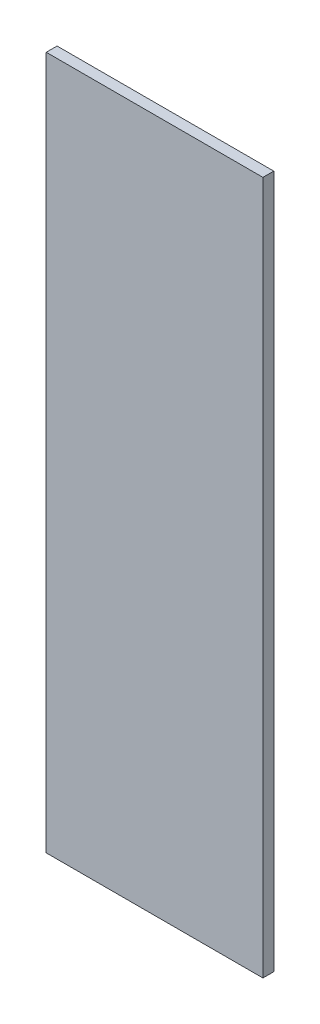
ISO-10303-21;
HEADER;
FILE_DESCRIPTION(('STEP AP214'),'2;1');
FILE_NAME('part.step','',(''),(''),'','','');
FILE_SCHEMA(('AUTOMOTIVE_DESIGN { 1 0 10303 214 1 1 1 1 }'));
ENDSEC;
DATA;
#1=APPLICATION_CONTEXT('core data for automotive mechanical design processes');
#2=APPLICATION_PROTOCOL_DEFINITION('international standard','automotive_design',2000,#1);
#3=PRODUCT_CONTEXT('',#1,'mechanical');
#4=PRODUCT('Part','Part','',(#3));
#5=PRODUCT_RELATED_PRODUCT_CATEGORY('part','',(#4));
#6=PRODUCT_DEFINITION_FORMATION('','',#4);
#7=PRODUCT_DEFINITION_CONTEXT('part definition',#1,'design');
#8=PRODUCT_DEFINITION('design','',#6,#7);
#9=PRODUCT_DEFINITION_SHAPE('','',#8);
#10=(LENGTH_UNIT() NAMED_UNIT(*) SI_UNIT(.MILLI.,.METRE.));
#11=(NAMED_UNIT(*) PLANE_ANGLE_UNIT() SI_UNIT($,.RADIAN.));
#12=(NAMED_UNIT(*) SI_UNIT($,.STERADIAN.) SOLID_ANGLE_UNIT());
#13=UNCERTAINTY_MEASURE_WITH_UNIT(LENGTH_MEASURE(1.E-05),#10,'distance_accuracy_value','');
#14=(GEOMETRIC_REPRESENTATION_CONTEXT(3) GLOBAL_UNCERTAINTY_ASSIGNED_CONTEXT((#13)) GLOBAL_UNIT_ASSIGNED_CONTEXT((#10,
#11,#12)) REPRESENTATION_CONTEXT('',''));
#15=CARTESIAN_POINT('',(0.,0.,0.));
#16=DIRECTION('',(0.,0.,1.));
#17=DIRECTION('',(1.,0.,0.));
#18=AXIS2_PLACEMENT_3D('',#15,#16,#17);
#19=CARTESIAN_POINT('',(50.,-160.,5.));
#20=DIRECTION('',(-1.,0.,0.));
#21=DIRECTION('',(0.,0.,1.));
#22=AXIS2_PLACEMENT_3D('',#19,#20,#21);
#23=PLANE('',#22);
#24=DIRECTION('',(0.,1.,0.));
#25=VECTOR('',#24,1.);
#26=CARTESIAN_POINT('',(50.,-160.,0.));
#27=LINE('',#26,#25);
#28=CARTESIAN_POINT('',(50.,-160.,0.));
#29=VERTEX_POINT('',#28);
#30=CARTESIAN_POINT('',(50.,160.,0.));
#31=VERTEX_POINT('',#30);
#32=EDGE_CURVE('E96',#29,#31,#27,.T.);
#33=ORIENTED_EDGE('',*,*,#32,.T.);
#34=DIRECTION('',(0.,0.,-1.));
#35=VECTOR('',#34,1.);
#36=CARTESIAN_POINT('',(50.,160.,5.));
#37=LINE('',#36,#35);
#38=CARTESIAN_POINT('',(50.,160.,5.));
#39=VERTEX_POINT('',#38);
#40=EDGE_CURVE('E11',#39,#31,#37,.T.);
#41=ORIENTED_EDGE('',*,*,#40,.F.);
#42=DIRECTION('',(0.,1.,0.));
#43=VECTOR('',#42,1.);
#44=CARTESIAN_POINT('',(50.,-160.,5.));
#45=LINE('',#44,#43);
#46=CARTESIAN_POINT('',(50.,-160.,5.));
#47=VERTEX_POINT('',#46);
#48=EDGE_CURVE('E84',#47,#39,#45,.T.);
#49=ORIENTED_EDGE('',*,*,#48,.F.);
#50=DIRECTION('',(0.,0.,-1.));
#51=VECTOR('',#50,1.);
#52=CARTESIAN_POINT('',(50.,-160.,5.));
#53=LINE('',#52,#51);
#54=EDGE_CURVE('E92',#47,#29,#53,.T.);
#55=ORIENTED_EDGE('',*,*,#54,.T.);
#56=EDGE_LOOP('',(#33,#41,#49,#55));
#57=FACE_BOUND('',#56,.T.);
#58=ADVANCED_FACE('F33',(#57),#23,.F.);
#59=CARTESIAN_POINT('',(-50.,160.,5.));
#60=DIRECTION('',(0.,-1.,0.));
#61=DIRECTION('',(0.,0.,-1.));
#62=AXIS2_PLACEMENT_3D('',#59,#60,#61);
#63=PLANE('',#62);
#64=DIRECTION('',(-1.,0.,0.));
#65=VECTOR('',#64,1.);
#66=CARTESIAN_POINT('',(-50.,160.,0.));
#67=LINE('',#66,#65);
#68=CARTESIAN_POINT('',(-50.,160.,0.));
#69=VERTEX_POINT('',#68);
#70=EDGE_CURVE('E88',#31,#69,#67,.T.);
#71=ORIENTED_EDGE('',*,*,#70,.T.);
#72=DIRECTION('',(0.,0.,-1.));
#73=VECTOR('',#72,1.);
#74=CARTESIAN_POINT('',(-50.,160.,5.));
#75=LINE('',#74,#73);
#76=CARTESIAN_POINT('',(-50.,160.,5.));
#77=VERTEX_POINT('',#76);
#78=EDGE_CURVE('E41',#77,#69,#75,.T.);
#79=ORIENTED_EDGE('',*,*,#78,.F.);
#80=DIRECTION('',(-1.,0.,0.));
#81=VECTOR('',#80,1.);
#82=CARTESIAN_POINT('',(-50.,160.,5.));
#83=LINE('',#82,#81);
#84=EDGE_CURVE('E79',#39,#77,#83,.T.);
#85=ORIENTED_EDGE('',*,*,#84,.F.);
#86=ORIENTED_EDGE('',*,*,#40,.T.);
#87=EDGE_LOOP('',(#71,#79,#85,#86));
#88=FACE_BOUND('',#87,.T.);
#89=ADVANCED_FACE('F87',(#88),#63,.F.);
#90=CARTESIAN_POINT('',(-50.,-160.,5.));
#91=DIRECTION('',(1.,0.,0.));
#92=DIRECTION('',(0.,0.,-1.));
#93=AXIS2_PLACEMENT_3D('',#90,#91,#92);
#94=PLANE('',#93);
#95=DIRECTION('',(0.,-1.,0.));
#96=VECTOR('',#95,1.);
#97=CARTESIAN_POINT('',(-50.,-160.,0.));
#98=LINE('',#97,#96);
#99=CARTESIAN_POINT('',(-50.,-160.,0.));
#100=VERTEX_POINT('',#99);
#101=EDGE_CURVE('E66',#69,#100,#98,.T.);
#102=ORIENTED_EDGE('',*,*,#101,.T.);
#103=DIRECTION('',(0.,0.,-1.));
#104=VECTOR('',#103,1.);
#105=CARTESIAN_POINT('',(-50.,-160.,5.));
#106=LINE('',#105,#104);
#107=CARTESIAN_POINT('',(-50.,-160.,5.));
#108=VERTEX_POINT('',#107);
#109=EDGE_CURVE('E89',#108,#100,#106,.T.);
#110=ORIENTED_EDGE('',*,*,#109,.F.);
#111=DIRECTION('',(0.,-1.,0.));
#112=VECTOR('',#111,1.);
#113=CARTESIAN_POINT('',(-50.,-160.,5.));
#114=LINE('',#113,#112);
#115=EDGE_CURVE('E82',#77,#108,#114,.T.);
#116=ORIENTED_EDGE('',*,*,#115,.F.);
#117=ORIENTED_EDGE('',*,*,#78,.T.);
#118=EDGE_LOOP('',(#102,#110,#116,#117));
#119=FACE_BOUND('',#118,.T.);
#120=ADVANCED_FACE('F90',(#119),#94,.F.);
#121=CARTESIAN_POINT('',(-50.,-160.,5.));
#122=DIRECTION('',(0.,1.,0.));
#123=DIRECTION('',(0.,0.,1.));
#124=AXIS2_PLACEMENT_3D('',#121,#122,#123);
#125=PLANE('',#124);
#126=DIRECTION('',(1.,0.,0.));
#127=VECTOR('',#126,1.);
#128=CARTESIAN_POINT('',(-50.,-160.,0.));
#129=LINE('',#128,#127);
#130=EDGE_CURVE('E72',#100,#29,#129,.T.);
#131=ORIENTED_EDGE('',*,*,#130,.T.);
#132=ORIENTED_EDGE('',*,*,#54,.F.);
#133=DIRECTION('',(1.,0.,0.));
#134=VECTOR('',#133,1.);
#135=CARTESIAN_POINT('',(-50.,-160.,5.));
#136=LINE('',#135,#134);
#137=EDGE_CURVE('E49',#108,#47,#136,.T.);
#138=ORIENTED_EDGE('',*,*,#137,.F.);
#139=ORIENTED_EDGE('',*,*,#109,.T.);
#140=EDGE_LOOP('',(#131,#132,#138,#139));
#141=FACE_BOUND('',#140,.T.);
#142=ADVANCED_FACE('F103',(#141),#125,.F.);
#143=CARTESIAN_POINT('',(0.,0.,5.));
#144=DIRECTION('',(0.,0.,-1.));
#145=DIRECTION('',(-1.,0.,0.));
#146=AXIS2_PLACEMENT_3D('',#143,#144,#145);
#147=PLANE('',#146);
#148=ORIENTED_EDGE('',*,*,#48,.T.);
#149=ORIENTED_EDGE('',*,*,#84,.T.);
#150=ORIENTED_EDGE('',*,*,#115,.T.);
#151=ORIENTED_EDGE('',*,*,#137,.T.);
#152=EDGE_LOOP('',(#148,#149,#150,#151));
#153=FACE_BOUND('',#152,.T.);
#154=ADVANCED_FACE('F80',(#153),#147,.F.);
#155=CARTESIAN_POINT('',(0.,0.,0.));
#156=DIRECTION('',(0.,0.,-1.));
#157=DIRECTION('',(-1.,0.,0.));
#158=AXIS2_PLACEMENT_3D('',#155,#156,#157);
#159=PLANE('',#158);
#160=ORIENTED_EDGE('',*,*,#32,.F.);
#161=ORIENTED_EDGE('',*,*,#130,.F.);
#162=ORIENTED_EDGE('',*,*,#101,.F.);
#163=ORIENTED_EDGE('',*,*,#70,.F.);
#164=EDGE_LOOP('',(#160,#161,#162,#163));
#165=FACE_BOUND('',#164,.T.);
#166=ADVANCED_FACE('F106',(#165),#159,.T.);
#167=CLOSED_SHELL('',(#58,#89,#120,#142,#154,#166));
#168=MANIFOLD_SOLID_BREP('B2',#167);
#169=ADVANCED_BREP_SHAPE_REPRESENTATION('',(#18,#168),#14);
#170=SHAPE_DEFINITION_REPRESENTATION(#9,#169);
ENDSEC;
END-ISO-10303-21;
